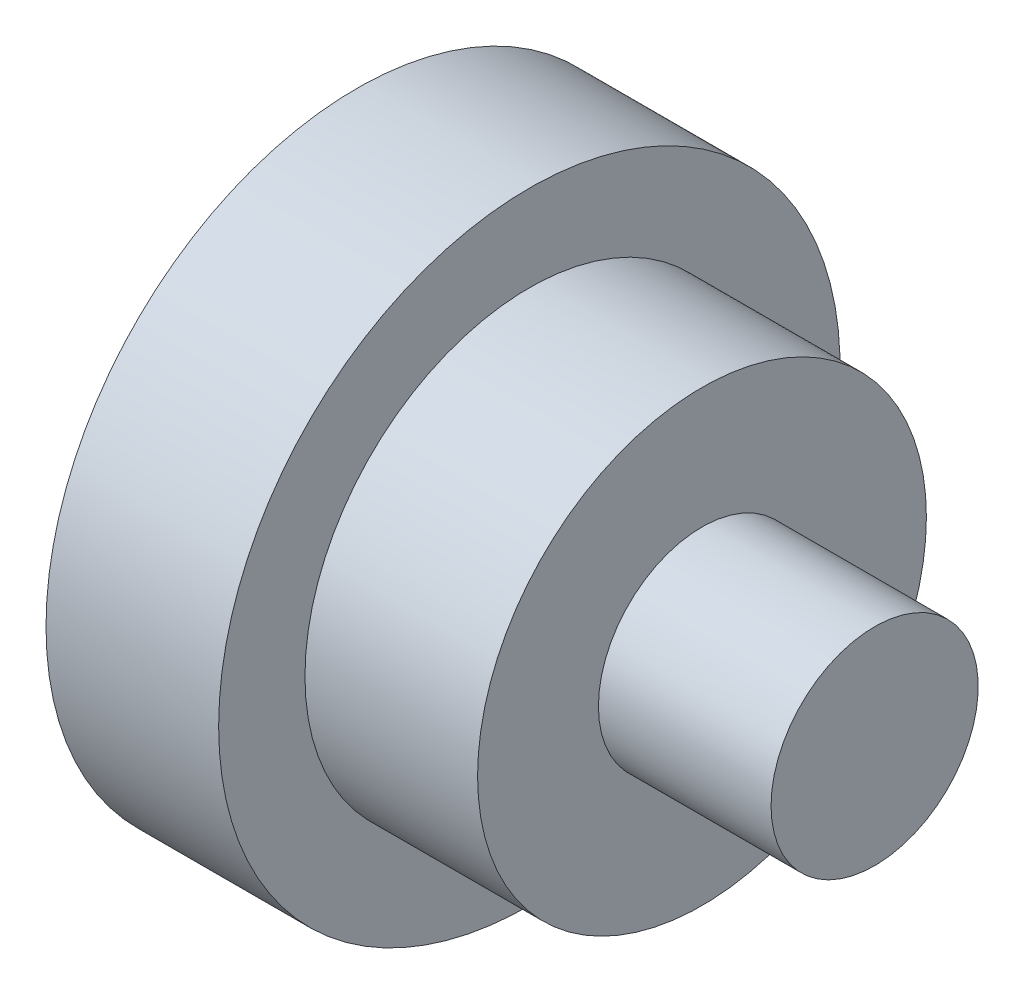
ISO-10303-21;
HEADER;
FILE_DESCRIPTION(('STEP AP214'),'2;1');
FILE_NAME('part.step','',(''),(''),'','','');
FILE_SCHEMA(('AUTOMOTIVE_DESIGN { 1 0 10303 214 1 1 1 1 }'));
ENDSEC;
DATA;
#1=APPLICATION_CONTEXT('core data for automotive mechanical design processes');
#2=APPLICATION_PROTOCOL_DEFINITION('international standard','automotive_design',2000,#1);
#3=PRODUCT_CONTEXT('',#1,'mechanical');
#4=PRODUCT('Part','Part','',(#3));
#5=PRODUCT_RELATED_PRODUCT_CATEGORY('part','',(#4));
#6=PRODUCT_DEFINITION_FORMATION('','',#4);
#7=PRODUCT_DEFINITION_CONTEXT('part definition',#1,'design');
#8=PRODUCT_DEFINITION('design','',#6,#7);
#9=PRODUCT_DEFINITION_SHAPE('','',#8);
#10=(LENGTH_UNIT() NAMED_UNIT(*) SI_UNIT(.MILLI.,.METRE.));
#11=(NAMED_UNIT(*) PLANE_ANGLE_UNIT() SI_UNIT($,.RADIAN.));
#12=(NAMED_UNIT(*) SI_UNIT($,.STERADIAN.) SOLID_ANGLE_UNIT());
#13=UNCERTAINTY_MEASURE_WITH_UNIT(LENGTH_MEASURE(1.E-05),#10,'distance_accuracy_value','');
#14=(GEOMETRIC_REPRESENTATION_CONTEXT(3) GLOBAL_UNCERTAINTY_ASSIGNED_CONTEXT((#13)) GLOBAL_UNIT_ASSIGNED_CONTEXT((#10,
#11,#12)) REPRESENTATION_CONTEXT('',''));
#15=CARTESIAN_POINT('',(0.,0.,0.));
#16=DIRECTION('',(0.,0.,1.));
#17=DIRECTION('',(1.,0.,0.));
#18=AXIS2_PLACEMENT_3D('',#15,#16,#17);
#19=CARTESIAN_POINT('',(0.,0.,0.));
#20=DIRECTION('',(-1.,0.,0.));
#21=DIRECTION('',(0.,0.,1.));
#22=AXIS2_PLACEMENT_3D('',#19,#20,#21);
#23=CYLINDRICAL_SURFACE('',#22,6.5);
#24=CARTESIAN_POINT('',(0.,0.,0.));
#25=DIRECTION('',(-1.,0.,0.));
#26=DIRECTION('',(0.,0.,1.));
#27=AXIS2_PLACEMENT_3D('',#24,#25,#26);
#28=CIRCLE('',#27,6.5);
#29=CARTESIAN_POINT('',(0.,0.,6.5));
#30=VERTEX_POINT('',#29);
#31=EDGE_CURVE('E10',#30,#30,#28,.T.);
#32=ORIENTED_EDGE('',*,*,#31,.F.);
#33=EDGE_LOOP('',(#32));
#34=FACE_BOUND('',#33,.T.);
#35=CARTESIAN_POINT('',(5.,0.,0.));
#36=DIRECTION('',(-1.,0.,0.));
#37=DIRECTION('',(0.,0.,1.));
#38=AXIS2_PLACEMENT_3D('',#35,#36,#37);
#39=CIRCLE('',#38,6.5);
#40=CARTESIAN_POINT('',(5.,0.,6.5));
#41=VERTEX_POINT('',#40);
#42=EDGE_CURVE('E39',#41,#41,#39,.T.);
#43=ORIENTED_EDGE('',*,*,#42,.T.);
#44=EDGE_LOOP('',(#43));
#45=FACE_BOUND('',#44,.T.);
#46=ADVANCED_FACE('F33',(#34,#45),#23,.T.);
#47=CARTESIAN_POINT('',(5.,6.5,0.));
#48=DIRECTION('',(-1.,0.,0.));
#49=DIRECTION('',(0.,0.,1.));
#50=AXIS2_PLACEMENT_3D('',#47,#48,#49);
#51=PLANE('',#50);
#52=ORIENTED_EDGE('',*,*,#42,.F.);
#53=EDGE_LOOP('',(#52));
#54=FACE_BOUND('',#53,.T.);
#55=CARTESIAN_POINT('',(5.,0.,0.));
#56=DIRECTION('',(-1.,0.,0.));
#57=DIRECTION('',(0.,0.,1.));
#58=AXIS2_PLACEMENT_3D('',#55,#56,#57);
#59=CIRCLE('',#58,3.);
#60=CARTESIAN_POINT('',(5.,0.,3.));
#61=VERTEX_POINT('',#60);
#62=EDGE_CURVE('E43',#61,#61,#59,.T.);
#63=ORIENTED_EDGE('',*,*,#62,.T.);
#64=EDGE_LOOP('',(#63));
#65=FACE_BOUND('',#64,.T.);
#66=ADVANCED_FACE('F92',(#54,#65),#51,.F.);
#67=CARTESIAN_POINT('',(0.,0.,0.));
#68=DIRECTION('',(-1.,0.,0.));
#69=DIRECTION('',(0.,0.,1.));
#70=AXIS2_PLACEMENT_3D('',#67,#68,#69);
#71=CYLINDRICAL_SURFACE('',#70,3.);
#72=ORIENTED_EDGE('',*,*,#62,.F.);
#73=EDGE_LOOP('',(#72));
#74=FACE_BOUND('',#73,.T.);
#75=CARTESIAN_POINT('',(10.,0.,0.));
#76=DIRECTION('',(-1.,0.,0.));
#77=DIRECTION('',(0.,0.,1.));
#78=AXIS2_PLACEMENT_3D('',#75,#76,#77);
#79=CIRCLE('',#78,3.);
#80=CARTESIAN_POINT('',(10.,0.,3.));
#81=VERTEX_POINT('',#80);
#82=EDGE_CURVE('E47',#81,#81,#79,.T.);
#83=ORIENTED_EDGE('',*,*,#82,.T.);
#84=EDGE_LOOP('',(#83));
#85=FACE_BOUND('',#84,.T.);
#86=ADVANCED_FACE('F97',(#74,#85),#71,.T.);
#87=CARTESIAN_POINT('',(10.,3.,0.));
#88=DIRECTION('',(-1.,0.,0.));
#89=DIRECTION('',(0.,0.,1.));
#90=AXIS2_PLACEMENT_3D('',#87,#88,#89);
#91=PLANE('',#90);
#92=ORIENTED_EDGE('',*,*,#82,.F.);
#93=EDGE_LOOP('',(#92));
#94=FACE_BOUND('',#93,.T.);
#95=ADVANCED_FACE('F83',(#94),#91,.F.);
#96=CARTESIAN_POINT('',(-5.,0.,0.));
#97=DIRECTION('',(1.,0.,0.));
#98=DIRECTION('',(0.,0.,-1.));
#99=AXIS2_PLACEMENT_3D('',#96,#97,#98);
#100=CYLINDRICAL_SURFACE('',#99,9.);
#101=CARTESIAN_POINT('',(-5.,0.,0.));
#102=DIRECTION('',(-1.,0.,0.));
#103=DIRECTION('',(0.,0.,1.));
#104=AXIS2_PLACEMENT_3D('',#101,#102,#103);
#105=CIRCLE('',#104,9.);
#106=CARTESIAN_POINT('',(-5.,0.,9.));
#107=VERTEX_POINT('',#106);
#108=EDGE_CURVE('E52',#107,#107,#105,.T.);
#109=ORIENTED_EDGE('',*,*,#108,.F.);
#110=EDGE_LOOP('',(#109));
#111=FACE_BOUND('',#110,.T.);
#112=CARTESIAN_POINT('',(0.,0.,0.));
#113=DIRECTION('',(-1.,0.,0.));
#114=DIRECTION('',(0.,0.,1.));
#115=AXIS2_PLACEMENT_3D('',#112,#113,#114);
#116=CIRCLE('',#115,9.);
#117=CARTESIAN_POINT('',(0.,0.,9.));
#118=VERTEX_POINT('',#117);
#119=EDGE_CURVE('E53',#118,#118,#116,.T.);
#120=ORIENTED_EDGE('',*,*,#119,.T.);
#121=EDGE_LOOP('',(#120));
#122=FACE_BOUND('',#121,.T.);
#123=ADVANCED_FACE('F77',(#111,#122),#100,.T.);
#124=CARTESIAN_POINT('',(-5.,0.,0.));
#125=DIRECTION('',(-1.,0.,0.));
#126=DIRECTION('',(0.,0.,1.));
#127=AXIS2_PLACEMENT_3D('',#124,#125,#126);
#128=PLANE('',#127);
#129=CARTESIAN_POINT('',(-5.,0.,0.));
#130=DIRECTION('',(-1.,0.,0.));
#131=DIRECTION('',(0.,0.,1.));
#132=AXIS2_PLACEMENT_3D('',#129,#130,#131);
#133=CIRCLE('',#132,5.);
#134=CARTESIAN_POINT('',(-5.,0.,5.));
#135=VERTEX_POINT('',#134);
#136=EDGE_CURVE('E59',#135,#135,#133,.T.);
#137=ORIENTED_EDGE('',*,*,#136,.F.);
#138=EDGE_LOOP('',(#137));
#139=FACE_BOUND('',#138,.T.);
#140=ORIENTED_EDGE('',*,*,#108,.T.);
#141=EDGE_LOOP('',(#140));
#142=FACE_BOUND('',#141,.T.);
#143=ADVANCED_FACE('F74',(#139,#142),#128,.T.);
#144=CARTESIAN_POINT('',(0.,0.,0.));
#145=DIRECTION('',(-1.,0.,0.));
#146=DIRECTION('',(0.,0.,1.));
#147=AXIS2_PLACEMENT_3D('',#144,#145,#146);
#148=PLANE('',#147);
#149=ORIENTED_EDGE('',*,*,#31,.T.);
#150=EDGE_LOOP('',(#149));
#151=FACE_BOUND('',#150,.T.);
#152=ORIENTED_EDGE('',*,*,#119,.F.);
#153=EDGE_LOOP('',(#152));
#154=FACE_BOUND('',#153,.T.);
#155=ADVANCED_FACE('F70',(#151,#154),#148,.F.);
#156=CARTESIAN_POINT('',(3.,0.,0.));
#157=DIRECTION('',(-1.,0.,0.));
#158=DIRECTION('',(0.,0.,1.));
#159=AXIS2_PLACEMENT_3D('',#156,#157,#158);
#160=CYLINDRICAL_SURFACE('',#159,5.);
#161=CARTESIAN_POINT('',(3.,0.,0.));
#162=DIRECTION('',(-1.,0.,0.));
#163=DIRECTION('',(0.,0.,1.));
#164=AXIS2_PLACEMENT_3D('',#161,#162,#163);
#165=CIRCLE('',#164,5.);
#166=CARTESIAN_POINT('',(3.,0.,5.));
#167=VERTEX_POINT('',#166);
#168=EDGE_CURVE('E56',#167,#167,#165,.T.);
#169=ORIENTED_EDGE('',*,*,#168,.F.);
#170=EDGE_LOOP('',(#169));
#171=FACE_BOUND('',#170,.T.);
#172=ORIENTED_EDGE('',*,*,#136,.T.);
#173=EDGE_LOOP('',(#172));
#174=FACE_BOUND('',#173,.T.);
#175=ADVANCED_FACE('F67',(#171,#174),#160,.F.);
#176=CARTESIAN_POINT('',(3.,0.,0.));
#177=DIRECTION('',(-1.,0.,0.));
#178=DIRECTION('',(0.,0.,1.));
#179=AXIS2_PLACEMENT_3D('',#176,#177,#178);
#180=PLANE('',#179);
#181=ORIENTED_EDGE('',*,*,#168,.T.);
#182=EDGE_LOOP('',(#181));
#183=FACE_BOUND('',#182,.T.);
#184=ADVANCED_FACE('F65',(#183),#180,.T.);
#185=CLOSED_SHELL('',(#46,#66,#86,#95,#123,#143,#155,#175,#184));
#186=MANIFOLD_SOLID_BREP('B2',#185);
#187=ADVANCED_BREP_SHAPE_REPRESENTATION('',(#18,#186),#14);
#188=SHAPE_DEFINITION_REPRESENTATION(#9,#187);
ENDSEC;
END-ISO-10303-21;
